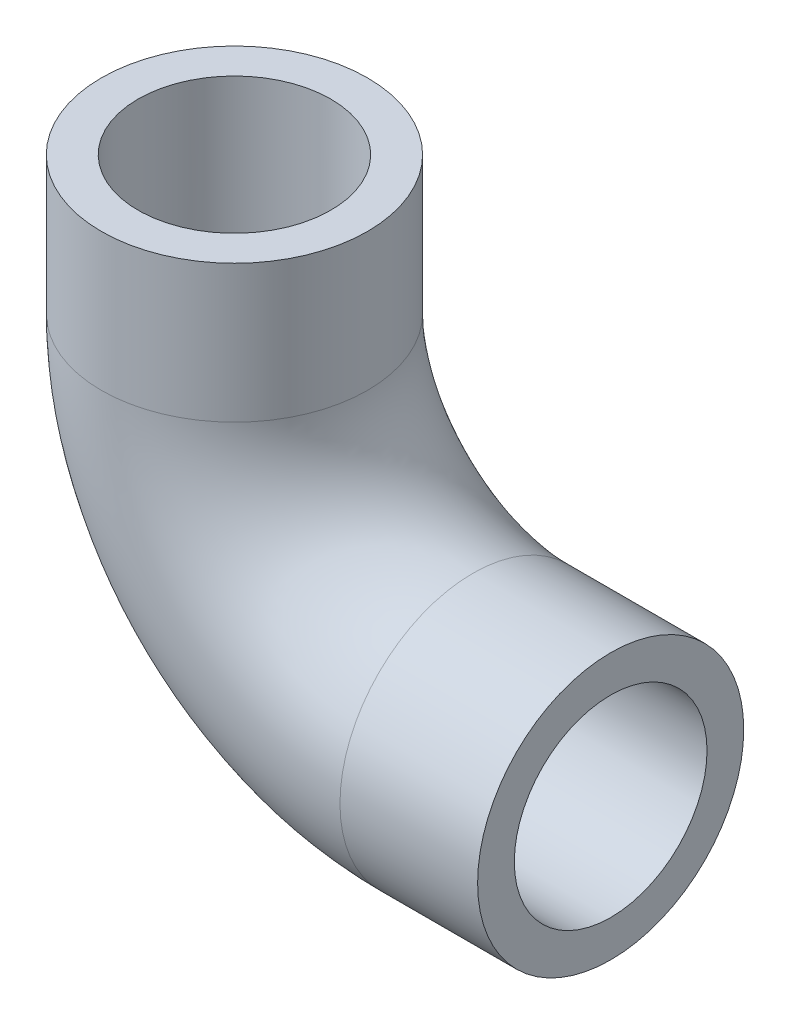
ISO-10303-21;
HEADER;
FILE_DESCRIPTION(('STEP AP214'),'2;1');
FILE_NAME('part.step','',(''),(''),'','','');
FILE_SCHEMA(('AUTOMOTIVE_DESIGN { 1 0 10303 214 1 1 1 1 }'));
ENDSEC;
DATA;
#1=APPLICATION_CONTEXT('core data for automotive mechanical design processes');
#2=APPLICATION_PROTOCOL_DEFINITION('international standard','automotive_design',2000,#1);
#3=PRODUCT_CONTEXT('',#1,'mechanical');
#4=PRODUCT('Part','Part','',(#3));
#5=PRODUCT_RELATED_PRODUCT_CATEGORY('part','',(#4));
#6=PRODUCT_DEFINITION_FORMATION('','',#4);
#7=PRODUCT_DEFINITION_CONTEXT('part definition',#1,'design');
#8=PRODUCT_DEFINITION('design','',#6,#7);
#9=PRODUCT_DEFINITION_SHAPE('','',#8);
#10=(LENGTH_UNIT() NAMED_UNIT(*) SI_UNIT(.MILLI.,.METRE.));
#11=(NAMED_UNIT(*) PLANE_ANGLE_UNIT() SI_UNIT($,.RADIAN.));
#12=(NAMED_UNIT(*) SI_UNIT($,.STERADIAN.) SOLID_ANGLE_UNIT());
#13=UNCERTAINTY_MEASURE_WITH_UNIT(LENGTH_MEASURE(1.E-05),#10,'distance_accuracy_value','');
#14=(GEOMETRIC_REPRESENTATION_CONTEXT(3) GLOBAL_UNCERTAINTY_ASSIGNED_CONTEXT((#13)) GLOBAL_UNIT_ASSIGNED_CONTEXT((#10,
#11,#12)) REPRESENTATION_CONTEXT('',''));
#15=CARTESIAN_POINT('',(0.,0.,0.));
#16=DIRECTION('',(0.,0.,1.));
#17=DIRECTION('',(1.,0.,0.));
#18=AXIS2_PLACEMENT_3D('',#15,#16,#17);
#19=CARTESIAN_POINT('',(0.,0.,0.));
#20=DIRECTION('',(1.,0.,0.));
#21=DIRECTION('',(0.,0.,-1.));
#22=AXIS2_PLACEMENT_3D('',#19,#20,#21);
#23=PLANE('',#22);
#24=CARTESIAN_POINT('',(0.,0.,0.));
#25=DIRECTION('',(1.,0.,0.));
#26=DIRECTION('',(0.,1.,0.));
#27=AXIS2_PLACEMENT_3D('',#24,#25,#26);
#28=CIRCLE('',#27,105.);
#29=CARTESIAN_POINT('',(0.,105.,0.));
#30=VERTEX_POINT('',#29);
#31=EDGE_CURVE('E77',#30,#30,#28,.T.);
#32=ORIENTED_EDGE('',*,*,#31,.F.);
#33=EDGE_LOOP('',(#32));
#34=FACE_BOUND('',#33,.T.);
#35=CARTESIAN_POINT('',(0.,0.,0.));
#36=DIRECTION('',(1.,0.,0.));
#37=DIRECTION('',(0.,0.,-1.));
#38=AXIS2_PLACEMENT_3D('',#35,#36,#37);
#39=CIRCLE('',#38,145.);
#40=CARTESIAN_POINT('',(0.,0.,-145.));
#41=VERTEX_POINT('',#40);
#42=EDGE_CURVE('E66',#41,#41,#39,.T.);
#43=ORIENTED_EDGE('',*,*,#42,.T.);
#44=EDGE_LOOP('',(#43));
#45=FACE_BOUND('',#44,.T.);
#46=ADVANCED_FACE('F49',(#34,#45),#23,.T.);
#47=CARTESIAN_POINT('',(-410.,410.,0.));
#48=DIRECTION('',(0.,-1.,0.));
#49=DIRECTION('',(0.,0.,-1.));
#50=AXIS2_PLACEMENT_3D('',#47,#48,#49);
#51=PLANE('',#50);
#52=CARTESIAN_POINT('',(-410.,410.,0.));
#53=DIRECTION('',(0.,-1.,0.));
#54=DIRECTION('',(0.,0.,-1.));
#55=AXIS2_PLACEMENT_3D('',#52,#53,#54);
#56=CIRCLE('',#55,105.);
#57=CARTESIAN_POINT('',(-410.,410.,-105.));
#58=VERTEX_POINT('',#57);
#59=EDGE_CURVE('E72',#58,#58,#56,.T.);
#60=ORIENTED_EDGE('',*,*,#59,.T.);
#61=EDGE_LOOP('',(#60));
#62=FACE_BOUND('',#61,.T.);
#63=CARTESIAN_POINT('',(-410.,410.,0.));
#64=DIRECTION('',(0.,-1.,0.));
#65=DIRECTION('',(0.,0.,-1.));
#66=AXIS2_PLACEMENT_3D('',#63,#64,#65);
#67=CIRCLE('',#66,145.);
#68=CARTESIAN_POINT('',(-410.,410.,-145.));
#69=VERTEX_POINT('',#68);
#70=EDGE_CURVE('E11',#69,#69,#67,.T.);
#71=ORIENTED_EDGE('',*,*,#70,.F.);
#72=EDGE_LOOP('',(#71));
#73=FACE_BOUND('',#72,.T.);
#74=ADVANCED_FACE('F100',(#62,#73),#51,.F.);
#75=CARTESIAN_POINT('',(0.,0.,0.));
#76=DIRECTION('',(-1.,0.,0.));
#77=DIRECTION('',(0.,-1.,0.));
#78=AXIS2_PLACEMENT_3D('',#75,#76,#77);
#79=CYLINDRICAL_SURFACE('',#78,145.);
#80=CARTESIAN_POINT('',(-150.,0.,0.));
#81=DIRECTION('',(1.,0.,0.));
#82=DIRECTION('',(0.,0.,-1.));
#83=AXIS2_PLACEMENT_3D('',#80,#81,#82);
#84=CIRCLE('',#83,145.);
#85=CARTESIAN_POINT('',(-150.,-145.,0.));
#86=VERTEX_POINT('',#85);
#87=EDGE_CURVE('E61',#86,#86,#84,.T.);
#88=ORIENTED_EDGE('',*,*,#87,.T.);
#89=EDGE_LOOP('',(#88));
#90=FACE_BOUND('',#89,.T.);
#91=ORIENTED_EDGE('',*,*,#42,.F.);
#92=EDGE_LOOP('',(#91));
#93=FACE_BOUND('',#92,.T.);
#94=ADVANCED_FACE('F104',(#90,#93),#79,.T.);
#95=CARTESIAN_POINT('',(-150.,260.,0.));
#96=DIRECTION('',(0.,0.,-1.));
#97=DIRECTION('',(-1.,0.,0.));
#98=AXIS2_PLACEMENT_3D('',#95,#96,#97);
#99=TOROIDAL_SURFACE('',#98,260.,145.);
#100=CARTESIAN_POINT('',(-410.,260.,0.));
#101=DIRECTION('',(0.,-1.,0.));
#102=DIRECTION('',(0.,0.,-1.));
#103=AXIS2_PLACEMENT_3D('',#100,#101,#102);
#104=CIRCLE('',#103,145.);
#105=CARTESIAN_POINT('',(-555.,260.,0.));
#106=VERTEX_POINT('',#105);
#107=EDGE_CURVE('E56',#106,#106,#104,.T.);
#108=CARTESIAN_POINT('',(-150.,260.,0.));
#109=DIRECTION('',(0.,0.,-1.));
#110=DIRECTION('',(-1.,0.,0.));
#111=AXIS2_PLACEMENT_3D('',#108,#109,#110);
#112=CIRCLE('',#111,405.);
#113=EDGE_CURVE('',#86,#106,#112,.T.);
#114=ORIENTED_EDGE('',*,*,#87,.F.);
#115=ORIENTED_EDGE('',*,*,#107,.T.);
#116=ORIENTED_EDGE('',*,*,#113,.T.);
#117=ORIENTED_EDGE('',*,*,#113,.F.);
#118=EDGE_LOOP('',(#114,#116,#115,#117));
#119=FACE_BOUND('',#118,.T.);
#120=ADVANCED_FACE('F106',(#119),#99,.T.);
#121=CARTESIAN_POINT('',(-410.,260.,0.));
#122=DIRECTION('',(0.,1.,0.));
#123=DIRECTION('',(-1.,0.,0.));
#124=AXIS2_PLACEMENT_3D('',#121,#122,#123);
#125=CYLINDRICAL_SURFACE('',#124,145.);
#126=ORIENTED_EDGE('',*,*,#70,.T.);
#127=EDGE_LOOP('',(#126));
#128=FACE_BOUND('',#127,.T.);
#129=ORIENTED_EDGE('',*,*,#107,.F.);
#130=EDGE_LOOP('',(#129));
#131=FACE_BOUND('',#130,.T.);
#132=ADVANCED_FACE('F94',(#128,#131),#125,.T.);
#133=CARTESIAN_POINT('',(0.,0.,0.));
#134=DIRECTION('',(-1.,0.,0.));
#135=DIRECTION('',(0.,-1.,0.));
#136=AXIS2_PLACEMENT_3D('',#133,#134,#135);
#137=CYLINDRICAL_SURFACE('',#136,105.);
#138=CARTESIAN_POINT('',(-150.,0.,0.));
#139=DIRECTION('',(-1.,0.,0.));
#140=DIRECTION('',(0.,-1.,0.));
#141=AXIS2_PLACEMENT_3D('',#138,#139,#140);
#142=CIRCLE('',#141,105.);
#143=CARTESIAN_POINT('',(-150.,-105.,0.));
#144=VERTEX_POINT('',#143);
#145=EDGE_CURVE('E81',#144,#144,#142,.F.);
#146=ORIENTED_EDGE('',*,*,#145,.F.);
#147=EDGE_LOOP('',(#146));
#148=FACE_BOUND('',#147,.T.);
#149=ORIENTED_EDGE('',*,*,#31,.T.);
#150=EDGE_LOOP('',(#149));
#151=FACE_BOUND('',#150,.T.);
#152=ADVANCED_FACE('F91',(#148,#151),#137,.F.);
#153=CARTESIAN_POINT('',(-150.,260.,0.));
#154=DIRECTION('',(0.,0.,-1.));
#155=DIRECTION('',(-1.,0.,0.));
#156=AXIS2_PLACEMENT_3D('',#153,#154,#155);
#157=TOROIDAL_SURFACE('',#156,260.,105.);
#158=CARTESIAN_POINT('',(-410.,260.,0.));
#159=DIRECTION('',(0.,-1.,0.));
#160=DIRECTION('',(1.,0.,0.));
#161=AXIS2_PLACEMENT_3D('',#158,#159,#160);
#162=CIRCLE('',#161,105.);
#163=CARTESIAN_POINT('',(-515.,260.,0.));
#164=VERTEX_POINT('',#163);
#165=EDGE_CURVE('E76',#164,#164,#162,.T.);
#166=CARTESIAN_POINT('',(-150.,260.,0.));
#167=DIRECTION('',(0.,0.,-1.));
#168=DIRECTION('',(-1.,0.,0.));
#169=AXIS2_PLACEMENT_3D('',#166,#167,#168);
#170=CIRCLE('',#169,365.);
#171=EDGE_CURVE('',#144,#164,#170,.T.);
#172=ORIENTED_EDGE('',*,*,#145,.T.);
#173=ORIENTED_EDGE('',*,*,#165,.F.);
#174=ORIENTED_EDGE('',*,*,#171,.T.);
#175=ORIENTED_EDGE('',*,*,#171,.F.);
#176=EDGE_LOOP('',(#172,#174,#173,#175));
#177=FACE_BOUND('',#176,.T.);
#178=ADVANCED_FACE('F89',(#177),#157,.F.);
#179=CARTESIAN_POINT('',(-410.,260.,0.));
#180=DIRECTION('',(0.,1.,0.));
#181=DIRECTION('',(-1.,0.,0.));
#182=AXIS2_PLACEMENT_3D('',#179,#180,#181);
#183=CYLINDRICAL_SURFACE('',#182,105.);
#184=ORIENTED_EDGE('',*,*,#59,.F.);
#185=EDGE_LOOP('',(#184));
#186=FACE_BOUND('',#185,.T.);
#187=ORIENTED_EDGE('',*,*,#165,.T.);
#188=EDGE_LOOP('',(#187));
#189=FACE_BOUND('',#188,.T.);
#190=ADVANCED_FACE('F101',(#186,#189),#183,.F.);
#191=CLOSED_SHELL('',(#46,#74,#94,#120,#132,#152,#178,#190));
#192=MANIFOLD_SOLID_BREP('B2',#191);
#193=ADVANCED_BREP_SHAPE_REPRESENTATION('',(#18,#192),#14);
#194=SHAPE_DEFINITION_REPRESENTATION(#9,#193);
ENDSEC;
END-ISO-10303-21;
